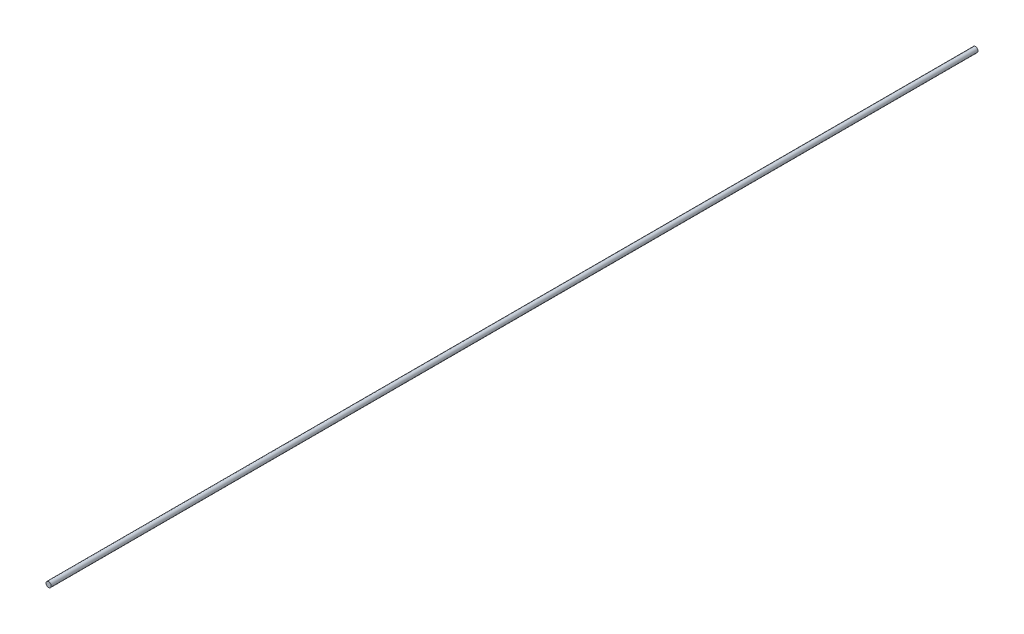
ISO-10303-21;
HEADER;
FILE_DESCRIPTION(('STEP AP214'),'2;1');
FILE_NAME('part.step','',(''),(''),'','','');
FILE_SCHEMA(('AUTOMOTIVE_DESIGN { 1 0 10303 214 1 1 1 1 }'));
ENDSEC;
DATA;
#1=APPLICATION_CONTEXT('core data for automotive mechanical design processes');
#2=APPLICATION_PROTOCOL_DEFINITION('international standard','automotive_design',2000,#1);
#3=PRODUCT_CONTEXT('',#1,'mechanical');
#4=PRODUCT('Part','Part','',(#3));
#5=PRODUCT_RELATED_PRODUCT_CATEGORY('part','',(#4));
#6=PRODUCT_DEFINITION_FORMATION('','',#4);
#7=PRODUCT_DEFINITION_CONTEXT('part definition',#1,'design');
#8=PRODUCT_DEFINITION('design','',#6,#7);
#9=PRODUCT_DEFINITION_SHAPE('','',#8);
#10=(LENGTH_UNIT() NAMED_UNIT(*) SI_UNIT(.MILLI.,.METRE.));
#11=(NAMED_UNIT(*) PLANE_ANGLE_UNIT() SI_UNIT($,.RADIAN.));
#12=(NAMED_UNIT(*) SI_UNIT($,.STERADIAN.) SOLID_ANGLE_UNIT());
#13=UNCERTAINTY_MEASURE_WITH_UNIT(LENGTH_MEASURE(1.E-05),#10,'distance_accuracy_value','');
#14=(GEOMETRIC_REPRESENTATION_CONTEXT(3) GLOBAL_UNCERTAINTY_ASSIGNED_CONTEXT((#13)) GLOBAL_UNIT_ASSIGNED_CONTEXT((#10,
#11,#12)) REPRESENTATION_CONTEXT('',''));
#15=CARTESIAN_POINT('',(0.,0.,0.));
#16=DIRECTION('',(0.,0.,1.));
#17=DIRECTION('',(1.,0.,0.));
#18=AXIS2_PLACEMENT_3D('',#15,#16,#17);
#19=CARTESIAN_POINT('',(2.69749500514394E-13,0.,1800.));
#20=DIRECTION('',(0.,0.,-1.));
#21=DIRECTION('',(-1.,0.,0.));
#22=AXIS2_PLACEMENT_3D('',#19,#20,#21);
#23=CYLINDRICAL_SURFACE('',#22,5.00000000000011);
#24=CARTESIAN_POINT('',(2.69749500514394E-13,0.,1800.));
#25=DIRECTION('',(0.,0.,-1.));
#26=DIRECTION('',(-1.,0.,0.));
#27=AXIS2_PLACEMENT_3D('',#24,#25,#26);
#28=CIRCLE('',#27,5.00000000000022);
#29=CARTESIAN_POINT('',(-4.99999999999995,0.,1800.));
#30=VERTEX_POINT('',#29);
#31=EDGE_CURVE('E10',#30,#30,#28,.T.);
#32=ORIENTED_EDGE('',*,*,#31,.T.);
#33=EDGE_LOOP('',(#32));
#34=FACE_BOUND('',#33,.T.);
#35=CARTESIAN_POINT('',(0.,0.,0.));
#36=DIRECTION('',(0.,0.,-1.));
#37=DIRECTION('',(-1.,0.,0.));
#38=AXIS2_PLACEMENT_3D('',#35,#36,#37);
#39=CIRCLE('',#38,5.);
#40=CARTESIAN_POINT('',(-5.,0.,0.));
#41=VERTEX_POINT('',#40);
#42=EDGE_CURVE('E37',#41,#41,#39,.T.);
#43=ORIENTED_EDGE('',*,*,#42,.F.);
#44=EDGE_LOOP('',(#43));
#45=FACE_BOUND('',#44,.T.);
#46=ADVANCED_FACE('F31',(#34,#45),#23,.T.);
#47=CARTESIAN_POINT('',(5.00000000000049,0.,1800.));
#48=DIRECTION('',(0.,0.,1.));
#49=DIRECTION('',(1.,0.,0.));
#50=AXIS2_PLACEMENT_3D('',#47,#48,#49);
#51=PLANE('',#50);
#52=ORIENTED_EDGE('',*,*,#31,.F.);
#53=EDGE_LOOP('',(#52));
#54=FACE_BOUND('',#53,.T.);
#55=ADVANCED_FACE('F46',(#54),#51,.T.);
#56=CARTESIAN_POINT('',(0.,0.,0.));
#57=DIRECTION('',(0.,0.,-1.));
#58=DIRECTION('',(-1.,0.,0.));
#59=AXIS2_PLACEMENT_3D('',#56,#57,#58);
#60=PLANE('',#59);
#61=ORIENTED_EDGE('',*,*,#42,.T.);
#62=EDGE_LOOP('',(#61));
#63=FACE_BOUND('',#62,.T.);
#64=ADVANCED_FACE('F43',(#63),#60,.T.);
#65=CLOSED_SHELL('',(#46,#55,#64));
#66=MANIFOLD_SOLID_BREP('B2',#65);
#67=ADVANCED_BREP_SHAPE_REPRESENTATION('',(#18,#66),#14);
#68=SHAPE_DEFINITION_REPRESENTATION(#9,#67);
ENDSEC;
END-ISO-10303-21;
